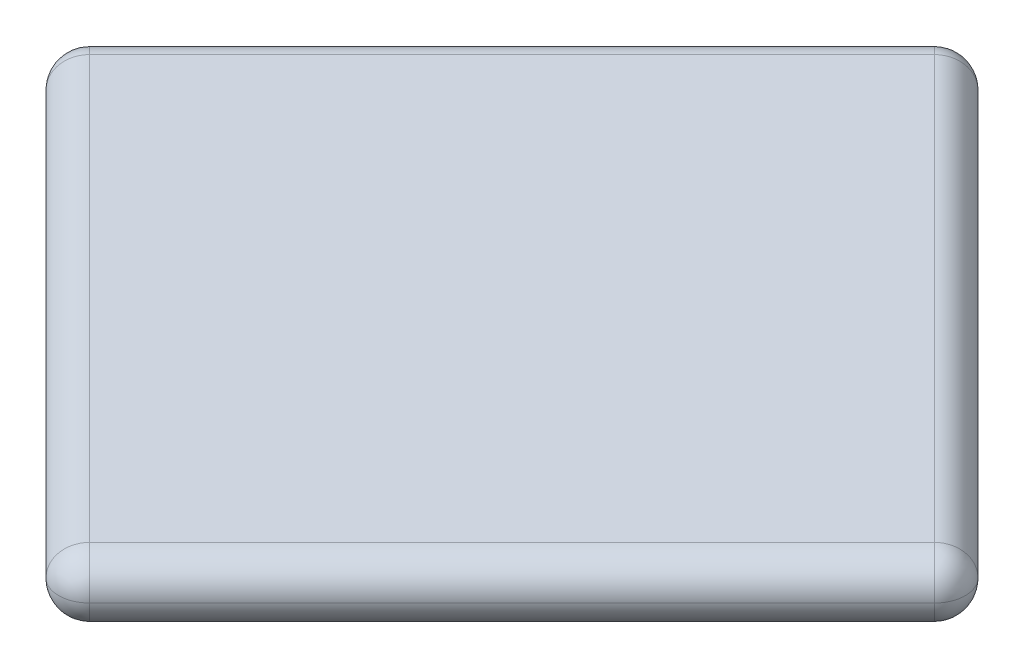
ISO-10303-21;
HEADER;
FILE_DESCRIPTION(('STEP AP214'),'2;1');
FILE_NAME('part.step','',(''),(''),'','','');
FILE_SCHEMA(('AUTOMOTIVE_DESIGN { 1 0 10303 214 1 1 1 1 }'));
ENDSEC;
DATA;
#1=APPLICATION_CONTEXT('core data for automotive mechanical design processes');
#2=APPLICATION_PROTOCOL_DEFINITION('international standard','automotive_design',2000,#1);
#3=PRODUCT_CONTEXT('',#1,'mechanical');
#4=PRODUCT('Part','Part','',(#3));
#5=PRODUCT_RELATED_PRODUCT_CATEGORY('part','',(#4));
#6=PRODUCT_DEFINITION_FORMATION('','',#4);
#7=PRODUCT_DEFINITION_CONTEXT('part definition',#1,'design');
#8=PRODUCT_DEFINITION('design','',#6,#7);
#9=PRODUCT_DEFINITION_SHAPE('','',#8);
#10=(LENGTH_UNIT() NAMED_UNIT(*) SI_UNIT(.MILLI.,.METRE.));
#11=(NAMED_UNIT(*) PLANE_ANGLE_UNIT() SI_UNIT($,.RADIAN.));
#12=(NAMED_UNIT(*) SI_UNIT($,.STERADIAN.) SOLID_ANGLE_UNIT());
#13=UNCERTAINTY_MEASURE_WITH_UNIT(LENGTH_MEASURE(1.E-05),#10,'distance_accuracy_value','');
#14=(GEOMETRIC_REPRESENTATION_CONTEXT(3) GLOBAL_UNCERTAINTY_ASSIGNED_CONTEXT((#13)) GLOBAL_UNIT_ASSIGNED_CONTEXT((#10,
#11,#12)) REPRESENTATION_CONTEXT('',''));
#15=CARTESIAN_POINT('',(0.,0.,0.));
#16=DIRECTION('',(0.,0.,1.));
#17=DIRECTION('',(1.,0.,0.));
#18=AXIS2_PLACEMENT_3D('',#15,#16,#17);
#19=CARTESIAN_POINT('',(274.558728752538,-20.,-2.97449235091454E-12));
#20=DIRECTION('',(0.,1.,0.));
#21=DIRECTION('',(0.,0.,1.));
#22=AXIS2_PLACEMENT_3D('',#19,#20,#21);
#23=PLANE('',#22);
#24=DIRECTION('',(-0.707106781186551,0.,-0.707106781186544));
#25=VECTOR('',#24,1.);
#26=CARTESIAN_POINT('',(274.558728752538,-20.,-3.05992892862146E-12));
#27=LINE('',#26,#25);
#28=CARTESIAN_POINT('',(0.,-20.,-274.558728752538));
#29=VERTEX_POINT('',#28);
#30=CARTESIAN_POINT('',(274.558728752538,-20.,-3.06606210228819E-12));
#31=VERTEX_POINT('',#30);
#32=EDGE_CURVE('E199',#29,#31,#27,.F.);
#33=ORIENTED_EDGE('',*,*,#32,.T.);
#34=DIRECTION('',(0.707106781186541,0.,-0.707106781186554));
#35=VECTOR('',#34,1.);
#36=CARTESIAN_POINT('',(2.01012359416095E-12,-20.,274.558728752538));
#37=LINE('',#36,#35);
#38=CARTESIAN_POINT('',(1.91712166781526E-12,-20.,274.558728752538));
#39=VERTEX_POINT('',#38);
#40=EDGE_CURVE('E112',#31,#39,#37,.F.);
#41=ORIENTED_EDGE('',*,*,#40,.T.);
#42=DIRECTION('',(0.707106781186551,0.,0.707106781186544));
#43=VECTOR('',#42,1.);
#44=CARTESIAN_POINT('',(-274.558728752538,-20.,1.04714160774573E-12));
#45=LINE('',#44,#43);
#46=CARTESIAN_POINT('',(-274.558728752538,-20.,9.59671056932257E-13));
#47=VERTEX_POINT('',#46);
#48=EDGE_CURVE('E204',#39,#47,#45,.F.);
#49=ORIENTED_EDGE('',*,*,#48,.T.);
#50=DIRECTION('',(-0.707106781186546,0.,0.707106781186549));
#51=VECTOR('',#50,1.);
#52=CARTESIAN_POINT('',(0.,-20.,-274.558728752538));
#53=LINE('',#52,#51);
#54=EDGE_CURVE('E93',#47,#29,#53,.F.);
#55=ORIENTED_EDGE('',*,*,#54,.T.);
#56=EDGE_LOOP('',(#33,#41,#49,#55));
#57=FACE_BOUND('',#56,.T.);
#58=ADVANCED_FACE('F33',(#57),#23,.F.);
#59=CARTESIAN_POINT('',(274.558728752538,20.,-2.97449235091454E-12));
#60=DIRECTION('',(0.,1.,0.));
#61=DIRECTION('',(0.,0.,1.));
#62=AXIS2_PLACEMENT_3D('',#59,#60,#61);
#63=PLANE('',#62);
#64=DIRECTION('',(0.707106781186551,0.,0.707106781186544));
#65=VECTOR('',#64,1.);
#66=CARTESIAN_POINT('',(8.88178419700125E-13,20.,274.558728752537));
#67=LINE('',#66,#65);
#68=CARTESIAN_POINT('',(-274.558728752538,20.,8.96169162700562E-13));
#69=VERTEX_POINT('',#68);
#70=CARTESIAN_POINT('',(1.89606979479373E-12,20.,274.558728752538));
#71=VERTEX_POINT('',#70);
#72=EDGE_CURVE('E43',#69,#71,#67,.T.);
#73=ORIENTED_EDGE('',*,*,#72,.T.);
#74=DIRECTION('',(0.707106781186541,0.,-0.707106781186554));
#75=VECTOR('',#74,1.);
#76=CARTESIAN_POINT('',(274.558728752538,20.,-2.97664489124521E-12));
#77=LINE('',#76,#75);
#78=CARTESIAN_POINT('',(274.558728752538,20.,-3.07219527595493E-12));
#79=VERTEX_POINT('',#78);
#80=EDGE_CURVE('E11',#71,#79,#77,.T.);
#81=ORIENTED_EDGE('',*,*,#80,.T.);
#82=DIRECTION('',(-0.707106781186551,0.,-0.707106781186544));
#83=VECTOR('',#82,1.);
#84=CARTESIAN_POINT('',(274.558728752538,20.,-2.93524003944744E-12));
#85=LINE('',#84,#83);
#86=CARTESIAN_POINT('',(0.,20.,-274.558728752538));
#87=VERTEX_POINT('',#86);
#88=EDGE_CURVE('E106',#79,#87,#85,.T.);
#89=ORIENTED_EDGE('',*,*,#88,.T.);
#90=DIRECTION('',(-0.707106781186546,0.,0.707106781186549));
#91=VECTOR('',#90,1.);
#92=CARTESIAN_POINT('',(9.43689570931383E-13,20.,-274.558728752539));
#93=LINE('',#92,#91);
#94=EDGE_CURVE('E108',#87,#69,#93,.T.);
#95=ORIENTED_EDGE('',*,*,#94,.T.);
#96=EDGE_LOOP('',(#73,#81,#89,#95));
#97=FACE_BOUND('',#96,.T.);
#98=ADVANCED_FACE('F107',(#97),#63,.T.);
#99=CARTESIAN_POINT('',(9.99200722162641E-13,0.,-274.558728752539));
#100=DIRECTION('',(-0.707106781186546,0.,0.707106781186549));
#101=DIRECTION('',(0.707106781186549,0.,0.707106781186546));
#102=AXIS2_PLACEMENT_3D('',#99,#100,#101);
#103=CYLINDRICAL_SURFACE('',#102,20.);
#104=CARTESIAN_POINT('',(-274.558728752538,0.,8.96169162700562E-13));
#105=DIRECTION('',(-0.70710678118655,0.,0.707106781186545));
#106=DIRECTION('',(0.707106781186545,0.,0.70710678118655));
#107=AXIS2_PLACEMENT_3D('',#104,#105,#106);
#108=CIRCLE('',#107,20.);
#109=CARTESIAN_POINT('',(-288.700864376269,0.,-14.1421356237301));
#110=VERTEX_POINT('',#109);
#111=EDGE_CURVE('E37',#69,#110,#108,.T.);
#112=ORIENTED_EDGE('',*,*,#111,.F.);
#113=ORIENTED_EDGE('',*,*,#94,.F.);
#114=CARTESIAN_POINT('',(0.,0.,-274.558728752538));
#115=DIRECTION('',(0.707106781186547,0.,-0.707106781186548));
#116=DIRECTION('',(-0.707106781186548,0.,-0.707106781186547));
#117=AXIS2_PLACEMENT_3D('',#114,#115,#116);
#118=CIRCLE('',#117,20.);
#119=CARTESIAN_POINT('',(-14.142135623731,0.,-288.700864376269));
#120=VERTEX_POINT('',#119);
#121=EDGE_CURVE('E79',#120,#87,#118,.T.);
#122=ORIENTED_EDGE('',*,*,#121,.F.);
#123=DIRECTION('',(-0.707106781186546,0.,0.707106781186549));
#124=VECTOR('',#123,1.);
#125=CARTESIAN_POINT('',(-14.142135623731,0.,-288.700864376269));
#126=LINE('',#125,#124);
#127=EDGE_CURVE('E122',#110,#120,#126,.F.);
#128=ORIENTED_EDGE('',*,*,#127,.F.);
#129=EDGE_LOOP('',(#112,#113,#122,#128));
#130=FACE_BOUND('',#129,.T.);
#131=ADVANCED_FACE('F35',(#130),#103,.T.);
#132=CARTESIAN_POINT('',(-274.558728752538,0.,9.59671056932257E-13));
#133=DIRECTION('',(0.,0.,1.));
#134=DIRECTION('',(1.,0.,0.));
#135=AXIS2_PLACEMENT_3D('',#132,#133,#134);
#136=SPHERICAL_SURFACE('',#135,20.);
#137=CARTESIAN_POINT('',(-274.558728752538,0.,9.59671056932257E-13));
#138=DIRECTION('',(0.707106781186556,0.,0.707106781186539));
#139=DIRECTION('',(0.707106781186539,0.,-0.707106781186556));
#140=AXIS2_PLACEMENT_3D('',#137,#138,#139);
#141=CIRCLE('',#140,20.);
#142=CARTESIAN_POINT('',(-288.700864376269,0.,14.1421356237321));
#143=VERTEX_POINT('',#142);
#144=EDGE_CURVE('E128',#69,#143,#141,.T.);
#145=ORIENTED_EDGE('',*,*,#144,.F.);
#146=ORIENTED_EDGE('',*,*,#111,.T.);
#147=CARTESIAN_POINT('',(-274.558728752538,0.,9.59671056932257E-13));
#148=DIRECTION('',(0.,1.,0.));
#149=DIRECTION('',(0.,0.,1.));
#150=AXIS2_PLACEMENT_3D('',#147,#148,#149);
#151=CIRCLE('',#150,20.);
#152=EDGE_CURVE('E131',#143,#110,#151,.F.);
#153=ORIENTED_EDGE('',*,*,#152,.F.);
#154=EDGE_LOOP('',(#145,#146,#153));
#155=FACE_BOUND('',#154,.T.);
#156=ADVANCED_FACE('F152',(#155),#136,.T.);
#157=CARTESIAN_POINT('',(0.,0.,-274.558728752538));
#158=DIRECTION('',(0.,0.,1.));
#159=DIRECTION('',(1.,0.,0.));
#160=AXIS2_PLACEMENT_3D('',#157,#158,#159);
#161=SPHERICAL_SURFACE('',#160,20.);
#162=CARTESIAN_POINT('',(0.,0.,-274.558728752538));
#163=DIRECTION('',(0.,1.,0.));
#164=DIRECTION('',(0.,0.,1.));
#165=AXIS2_PLACEMENT_3D('',#162,#163,#164);
#166=CIRCLE('',#165,20.);
#167=CARTESIAN_POINT('',(14.1421356237311,0.,-288.700864376269));
#168=VERTEX_POINT('',#167);
#169=EDGE_CURVE('E120',#120,#168,#166,.F.);
#170=ORIENTED_EDGE('',*,*,#169,.F.);
#171=ORIENTED_EDGE('',*,*,#121,.T.);
#172=CARTESIAN_POINT('',(1.12757025938492E-13,0.,-274.558728752538));
#173=DIRECTION('',(0.707106781186547,0.,0.707106781186548));
#174=DIRECTION('',(0.707106781186548,0.,-0.707106781186547));
#175=AXIS2_PLACEMENT_3D('',#172,#173,#174);
#176=CIRCLE('',#175,20.);
#177=EDGE_CURVE('E118',#168,#87,#176,.T.);
#178=ORIENTED_EDGE('',*,*,#177,.F.);
#179=EDGE_LOOP('',(#170,#171,#178));
#180=FACE_BOUND('',#179,.T.);
#181=ADVANCED_FACE('F117',(#180),#161,.T.);
#182=CARTESIAN_POINT('',(0.,0.,-274.558728752538));
#183=DIRECTION('',(0.707106781186546,0.,-0.707106781186549));
#184=DIRECTION('',(-0.707106781186549,0.,-0.707106781186546));
#185=AXIS2_PLACEMENT_3D('',#182,#183,#184);
#186=CYLINDRICAL_SURFACE('',#185,20.);
#187=CARTESIAN_POINT('',(-274.558728752538,0.,8.6389229103645E-13));
#188=DIRECTION('',(-0.707106781186547,0.,0.707106781186548));
#189=DIRECTION('',(0.707106781186548,0.,0.707106781186547));
#190=AXIS2_PLACEMENT_3D('',#187,#188,#189);
#191=CIRCLE('',#190,20.);
#192=EDGE_CURVE('E139',#110,#47,#191,.T.);
#193=ORIENTED_EDGE('',*,*,#192,.F.);
#194=ORIENTED_EDGE('',*,*,#127,.T.);
#195=CARTESIAN_POINT('',(0.,0.,-274.558728752538));
#196=DIRECTION('',(0.707106781186547,0.,-0.707106781186548));
#197=DIRECTION('',(-0.707106781186548,0.,-0.707106781186547));
#198=AXIS2_PLACEMENT_3D('',#195,#196,#197);
#199=CIRCLE('',#198,20.);
#200=EDGE_CURVE('E133',#29,#120,#199,.T.);
#201=ORIENTED_EDGE('',*,*,#200,.F.);
#202=ORIENTED_EDGE('',*,*,#54,.F.);
#203=EDGE_LOOP('',(#193,#194,#201,#202));
#204=FACE_BOUND('',#203,.T.);
#205=ADVANCED_FACE('F144',(#204),#186,.T.);
#206=CARTESIAN_POINT('',(-274.558728752538,0.,9.59671056932257E-13));
#207=DIRECTION('',(0.,0.,1.));
#208=DIRECTION('',(1.,0.,0.));
#209=AXIS2_PLACEMENT_3D('',#206,#207,#208);
#210=SPHERICAL_SURFACE('',#209,20.);
#211=ORIENTED_EDGE('',*,*,#152,.T.);
#212=ORIENTED_EDGE('',*,*,#192,.T.);
#213=CARTESIAN_POINT('',(-274.558728752538,0.,9.64506252643105E-13));
#214=DIRECTION('',(0.707106781186556,0.,0.707106781186539));
#215=DIRECTION('',(0.707106781186539,0.,-0.707106781186556));
#216=AXIS2_PLACEMENT_3D('',#213,#214,#215);
#217=CIRCLE('',#216,20.);
#218=EDGE_CURVE('E150',#143,#47,#217,.T.);
#219=ORIENTED_EDGE('',*,*,#218,.F.);
#220=EDGE_LOOP('',(#211,#212,#219));
#221=FACE_BOUND('',#220,.T.);
#222=ADVANCED_FACE('F149',(#221),#210,.T.);
#223=CARTESIAN_POINT('',(9.43689570931383E-13,0.,274.558728752537));
#224=DIRECTION('',(0.707106781186551,0.,0.707106781186544));
#225=DIRECTION('',(0.707106781186544,0.,-0.707106781186551));
#226=AXIS2_PLACEMENT_3D('',#223,#224,#225);
#227=CYLINDRICAL_SURFACE('',#226,20.);
#228=ORIENTED_EDGE('',*,*,#72,.F.);
#229=ORIENTED_EDGE('',*,*,#144,.T.);
#230=DIRECTION('',(0.707106781186551,0.,0.707106781186544));
#231=VECTOR('',#230,1.);
#232=CARTESIAN_POINT('',(-288.700864376269,0.,14.1421356237321));
#233=LINE('',#232,#231);
#234=CARTESIAN_POINT('',(-14.1421356237291,0.,288.700864376269));
#235=VERTEX_POINT('',#234);
#236=EDGE_CURVE('E155',#235,#143,#233,.F.);
#237=ORIENTED_EDGE('',*,*,#236,.F.);
#238=CARTESIAN_POINT('',(1.89606979479373E-12,0.,274.558728752538));
#239=DIRECTION('',(0.707106781186548,0.,0.707106781186547));
#240=DIRECTION('',(0.707106781186547,0.,-0.707106781186548));
#241=AXIS2_PLACEMENT_3D('',#238,#239,#240);
#242=CIRCLE('',#241,20.);
#243=EDGE_CURVE('E157',#71,#235,#242,.T.);
#244=ORIENTED_EDGE('',*,*,#243,.F.);
#245=EDGE_LOOP('',(#228,#229,#237,#244));
#246=FACE_BOUND('',#245,.T.);
#247=ADVANCED_FACE('F154',(#246),#227,.T.);
#248=CARTESIAN_POINT('',(274.558728752538,0.,-2.96783266220347E-12));
#249=DIRECTION('',(-0.707106781186551,0.,-0.707106781186544));
#250=DIRECTION('',(-0.707106781186544,0.,0.707106781186551));
#251=AXIS2_PLACEMENT_3D('',#248,#249,#250);
#252=CYLINDRICAL_SURFACE('',#251,20.);
#253=ORIENTED_EDGE('',*,*,#177,.T.);
#254=ORIENTED_EDGE('',*,*,#88,.F.);
#255=CARTESIAN_POINT('',(274.558728752538,0.,-3.07219527595493E-12));
#256=DIRECTION('',(0.707106781186551,0.,0.707106781186544));
#257=DIRECTION('',(0.707106781186544,0.,-0.707106781186551));
#258=AXIS2_PLACEMENT_3D('',#255,#256,#257);
#259=CIRCLE('',#258,20.);
#260=CARTESIAN_POINT('',(288.700864376269,0.,-14.1421356237341));
#261=VERTEX_POINT('',#260);
#262=EDGE_CURVE('E189',#261,#79,#259,.T.);
#263=ORIENTED_EDGE('',*,*,#262,.F.);
#264=DIRECTION('',(-0.707106781186551,0.,-0.707106781186544));
#265=VECTOR('',#264,1.);
#266=CARTESIAN_POINT('',(288.700864376269,0.,-14.1421356237341));
#267=LINE('',#266,#265);
#268=EDGE_CURVE('E126',#168,#261,#267,.F.);
#269=ORIENTED_EDGE('',*,*,#268,.F.);
#270=EDGE_LOOP('',(#253,#254,#263,#269));
#271=FACE_BOUND('',#270,.T.);
#272=ADVANCED_FACE('F124',(#271),#252,.T.);
#273=CARTESIAN_POINT('',(0.,0.,-274.558728752538));
#274=DIRECTION('',(0.,0.,1.));
#275=DIRECTION('',(1.,0.,0.));
#276=AXIS2_PLACEMENT_3D('',#273,#274,#275);
#277=SPHERICAL_SURFACE('',#276,20.);
#278=ORIENTED_EDGE('',*,*,#200,.T.);
#279=ORIENTED_EDGE('',*,*,#169,.T.);
#280=CARTESIAN_POINT('',(0.,0.,-274.558728752538));
#281=DIRECTION('',(0.707106781186547,0.,0.707106781186548));
#282=DIRECTION('',(0.707106781186548,0.,-0.707106781186547));
#283=AXIS2_PLACEMENT_3D('',#280,#281,#282);
#284=CIRCLE('',#283,20.);
#285=EDGE_CURVE('E186',#29,#168,#284,.T.);
#286=ORIENTED_EDGE('',*,*,#285,.F.);
#287=EDGE_LOOP('',(#278,#279,#286));
#288=FACE_BOUND('',#287,.T.);
#289=ADVANCED_FACE('F195',(#288),#277,.T.);
#290=CARTESIAN_POINT('',(-274.558728752538,0.,1.05818132034585E-12));
#291=DIRECTION('',(-0.707106781186551,0.,-0.707106781186544));
#292=DIRECTION('',(-0.707106781186544,0.,0.707106781186551));
#293=AXIS2_PLACEMENT_3D('',#290,#291,#292);
#294=CYLINDRICAL_SURFACE('',#293,20.);
#295=ORIENTED_EDGE('',*,*,#218,.T.);
#296=ORIENTED_EDGE('',*,*,#48,.F.);
#297=CARTESIAN_POINT('',(1.82666382020358E-12,0.,274.558728752538));
#298=DIRECTION('',(0.707106781186551,0.,0.707106781186544));
#299=DIRECTION('',(0.707106781186544,0.,-0.707106781186551));
#300=AXIS2_PLACEMENT_3D('',#297,#298,#299);
#301=CIRCLE('',#300,20.);
#302=EDGE_CURVE('E183',#235,#39,#301,.T.);
#303=ORIENTED_EDGE('',*,*,#302,.F.);
#304=ORIENTED_EDGE('',*,*,#236,.T.);
#305=EDGE_LOOP('',(#295,#296,#303,#304));
#306=FACE_BOUND('',#305,.T.);
#307=ADVANCED_FACE('F225',(#306),#294,.T.);
#308=CARTESIAN_POINT('',(1.91712166781526E-12,0.,274.558728752538));
#309=DIRECTION('',(0.,0.,1.));
#310=DIRECTION('',(1.,0.,0.));
#311=AXIS2_PLACEMENT_3D('',#308,#309,#310);
#312=SPHERICAL_SURFACE('',#311,20.);
#313=CARTESIAN_POINT('',(1.91712166781526E-12,0.,274.558728752538));
#314=DIRECTION('',(0.707106781186536,0.,-0.707106781186559));
#315=DIRECTION('',(-0.707106781186559,0.,-0.707106781186536));
#316=AXIS2_PLACEMENT_3D('',#313,#314,#315);
#317=CIRCLE('',#316,20.);
#318=CARTESIAN_POINT('',(14.1421356237331,0.,288.700864376269));
#319=VERTEX_POINT('',#318);
#320=EDGE_CURVE('E177',#71,#319,#317,.T.);
#321=ORIENTED_EDGE('',*,*,#320,.F.);
#322=ORIENTED_EDGE('',*,*,#243,.T.);
#323=CARTESIAN_POINT('',(1.91712166781526E-12,0.,274.558728752538));
#324=DIRECTION('',(0.,1.,0.));
#325=DIRECTION('',(0.,0.,1.));
#326=AXIS2_PLACEMENT_3D('',#323,#324,#325);
#327=CIRCLE('',#326,20.);
#328=EDGE_CURVE('E180',#319,#235,#327,.F.);
#329=ORIENTED_EDGE('',*,*,#328,.F.);
#330=EDGE_LOOP('',(#321,#322,#329));
#331=FACE_BOUND('',#330,.T.);
#332=ADVANCED_FACE('F227',(#331),#312,.T.);
#333=CARTESIAN_POINT('',(274.558728752538,0.,-2.97449235091454E-12));
#334=DIRECTION('',(0.,0.,1.));
#335=DIRECTION('',(1.,0.,0.));
#336=AXIS2_PLACEMENT_3D('',#333,#334,#335);
#337=SPHERICAL_SURFACE('',#336,20.);
#338=CARTESIAN_POINT('',(274.558728752538,0.,-2.97449235091454E-12));
#339=DIRECTION('',(0.,1.,0.));
#340=DIRECTION('',(0.,0.,1.));
#341=AXIS2_PLACEMENT_3D('',#338,#339,#340);
#342=CIRCLE('',#341,20.);
#343=CARTESIAN_POINT('',(288.700864376269,0.,14.1421356237279));
#344=VERTEX_POINT('',#343);
#345=EDGE_CURVE('E172',#261,#344,#342,.F.);
#346=ORIENTED_EDGE('',*,*,#345,.F.);
#347=ORIENTED_EDGE('',*,*,#262,.T.);
#348=CARTESIAN_POINT('',(274.558728752538,0.,-2.98198965520413E-12));
#349=DIRECTION('',(-0.707106781186547,0.,0.707106781186548));
#350=DIRECTION('',(0.707106781186548,0.,0.707106781186547));
#351=AXIS2_PLACEMENT_3D('',#348,#349,#350);
#352=CIRCLE('',#351,20.);
#353=EDGE_CURVE('E175',#344,#79,#352,.T.);
#354=ORIENTED_EDGE('',*,*,#353,.F.);
#355=EDGE_LOOP('',(#346,#347,#354));
#356=FACE_BOUND('',#355,.T.);
#357=ADVANCED_FACE('F233',(#356),#337,.T.);
#358=CARTESIAN_POINT('',(274.558728752538,0.,-3.07219527595493E-12));
#359=DIRECTION('',(0.707106781186551,0.,0.707106781186544));
#360=DIRECTION('',(0.707106781186544,0.,-0.707106781186551));
#361=AXIS2_PLACEMENT_3D('',#358,#359,#360);
#362=CYLINDRICAL_SURFACE('',#361,20.);
#363=ORIENTED_EDGE('',*,*,#285,.T.);
#364=ORIENTED_EDGE('',*,*,#268,.T.);
#365=CARTESIAN_POINT('',(274.558728752538,0.,-3.06606210228819E-12));
#366=DIRECTION('',(0.707106781186551,0.,0.707106781186544));
#367=DIRECTION('',(0.707106781186544,0.,-0.707106781186551));
#368=AXIS2_PLACEMENT_3D('',#365,#366,#367);
#369=CIRCLE('',#368,20.);
#370=EDGE_CURVE('E169',#31,#261,#369,.T.);
#371=ORIENTED_EDGE('',*,*,#370,.F.);
#372=ORIENTED_EDGE('',*,*,#32,.F.);
#373=EDGE_LOOP('',(#363,#364,#371,#372));
#374=FACE_BOUND('',#373,.T.);
#375=ADVANCED_FACE('F200',(#374),#362,.T.);
#376=CARTESIAN_POINT('',(1.91712166781526E-12,0.,274.558728752538));
#377=DIRECTION('',(0.,0.,1.));
#378=DIRECTION('',(1.,0.,0.));
#379=AXIS2_PLACEMENT_3D('',#376,#377,#378);
#380=SPHERICAL_SURFACE('',#379,20.);
#381=ORIENTED_EDGE('',*,*,#328,.T.);
#382=ORIENTED_EDGE('',*,*,#302,.T.);
#383=CARTESIAN_POINT('',(1.9220736113823E-12,0.,274.558728752538));
#384=DIRECTION('',(0.707106781186536,0.,-0.707106781186559));
#385=DIRECTION('',(-0.707106781186559,0.,-0.707106781186536));
#386=AXIS2_PLACEMENT_3D('',#383,#384,#385);
#387=CIRCLE('',#386,20.);
#388=EDGE_CURVE('E167',#319,#39,#387,.T.);
#389=ORIENTED_EDGE('',*,*,#388,.F.);
#390=EDGE_LOOP('',(#381,#382,#389));
#391=FACE_BOUND('',#390,.T.);
#392=ADVANCED_FACE('F222',(#391),#380,.T.);
#393=CARTESIAN_POINT('',(274.558728752538,0.,-2.97449235091454E-12));
#394=DIRECTION('',(0.707106781186541,0.,-0.707106781186554));
#395=DIRECTION('',(-0.707106781186554,0.,-0.707106781186541));
#396=AXIS2_PLACEMENT_3D('',#393,#394,#395);
#397=CYLINDRICAL_SURFACE('',#396,20.);
#398=ORIENTED_EDGE('',*,*,#80,.F.);
#399=ORIENTED_EDGE('',*,*,#320,.T.);
#400=DIRECTION('',(0.707106781186541,0.,-0.707106781186554));
#401=VECTOR('',#400,1.);
#402=CARTESIAN_POINT('',(14.1421356237331,0.,288.700864376269));
#403=LINE('',#402,#401);
#404=EDGE_CURVE('E164',#344,#319,#403,.F.);
#405=ORIENTED_EDGE('',*,*,#404,.F.);
#406=ORIENTED_EDGE('',*,*,#353,.T.);
#407=EDGE_LOOP('',(#398,#399,#405,#406));
#408=FACE_BOUND('',#407,.T.);
#409=ADVANCED_FACE('F219',(#408),#397,.T.);
#410=CARTESIAN_POINT('',(274.558728752538,0.,-2.97449235091454E-12));
#411=DIRECTION('',(0.,0.,1.));
#412=DIRECTION('',(1.,0.,0.));
#413=AXIS2_PLACEMENT_3D('',#410,#411,#412);
#414=SPHERICAL_SURFACE('',#413,20.);
#415=ORIENTED_EDGE('',*,*,#370,.T.);
#416=ORIENTED_EDGE('',*,*,#345,.T.);
#417=CARTESIAN_POINT('',(274.558728752538,0.,-2.97449235091454E-12));
#418=DIRECTION('',(-0.707106781186547,0.,0.707106781186548));
#419=DIRECTION('',(0.707106781186548,0.,0.707106781186547));
#420=AXIS2_PLACEMENT_3D('',#417,#418,#419);
#421=CIRCLE('',#420,20.);
#422=EDGE_CURVE('E161',#31,#344,#421,.T.);
#423=ORIENTED_EDGE('',*,*,#422,.F.);
#424=EDGE_LOOP('',(#415,#416,#423));
#425=FACE_BOUND('',#424,.T.);
#426=ADVANCED_FACE('F214',(#425),#414,.T.);
#427=CARTESIAN_POINT('',(2.01748340256103E-12,0.,274.558728752538));
#428=DIRECTION('',(-0.707106781186541,0.,0.707106781186554));
#429=DIRECTION('',(0.707106781186554,0.,0.707106781186541));
#430=AXIS2_PLACEMENT_3D('',#427,#428,#429);
#431=CYLINDRICAL_SURFACE('',#430,20.);
#432=ORIENTED_EDGE('',*,*,#388,.T.);
#433=ORIENTED_EDGE('',*,*,#40,.F.);
#434=ORIENTED_EDGE('',*,*,#422,.T.);
#435=ORIENTED_EDGE('',*,*,#404,.T.);
#436=EDGE_LOOP('',(#432,#433,#434,#435));
#437=FACE_BOUND('',#436,.T.);
#438=ADVANCED_FACE('F211',(#437),#431,.T.);
#439=CLOSED_SHELL('',(#58,#98,#131,#156,#181,#205,#222,#247,#272,#289,#307,#332,#357,#375,#392,
#409,#426,#438));
#440=MANIFOLD_SOLID_BREP('B2',#439);
#441=ADVANCED_BREP_SHAPE_REPRESENTATION('',(#18,#440),#14);
#442=SHAPE_DEFINITION_REPRESENTATION(#9,#441);
ENDSEC;
END-ISO-10303-21;
